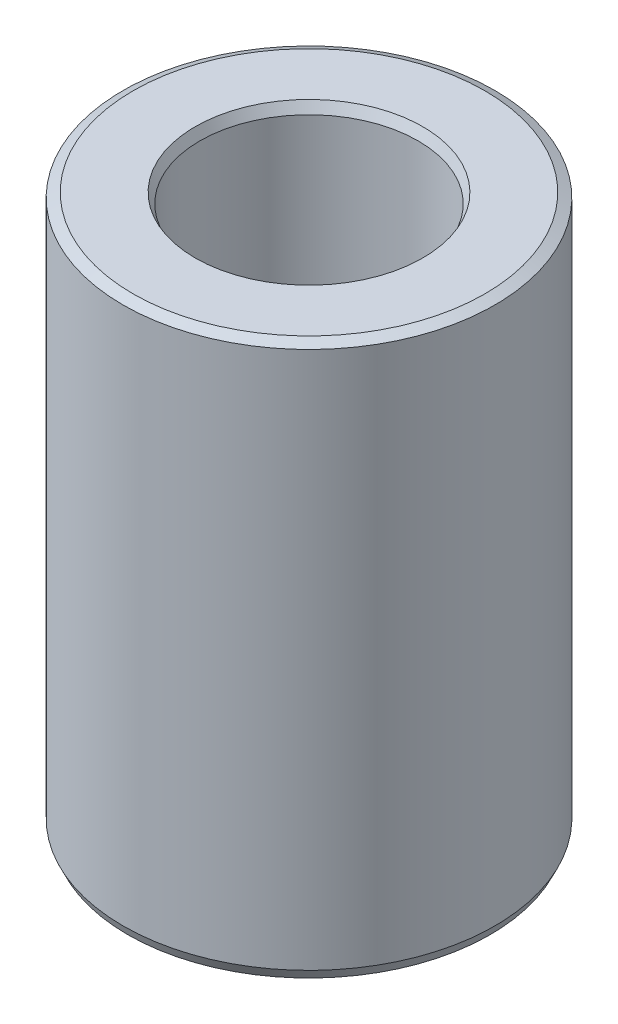
ISO-10303-21;
HEADER;
FILE_DESCRIPTION(('STEP AP214'),'2;1');
FILE_NAME('part.step','',(''),(''),'','','');
FILE_SCHEMA(('AUTOMOTIVE_DESIGN { 1 0 10303 214 1 1 1 1 }'));
ENDSEC;
DATA;
#1=APPLICATION_CONTEXT('core data for automotive mechanical design processes');
#2=APPLICATION_PROTOCOL_DEFINITION('international standard','automotive_design',2000,#1);
#3=PRODUCT_CONTEXT('',#1,'mechanical');
#4=PRODUCT('Part','Part','',(#3));
#5=PRODUCT_RELATED_PRODUCT_CATEGORY('part','',(#4));
#6=PRODUCT_DEFINITION_FORMATION('','',#4);
#7=PRODUCT_DEFINITION_CONTEXT('part definition',#1,'design');
#8=PRODUCT_DEFINITION('design','',#6,#7);
#9=PRODUCT_DEFINITION_SHAPE('','',#8);
#10=(LENGTH_UNIT() NAMED_UNIT(*) SI_UNIT(.MILLI.,.METRE.));
#11=(NAMED_UNIT(*) PLANE_ANGLE_UNIT() SI_UNIT($,.RADIAN.));
#12=(NAMED_UNIT(*) SI_UNIT($,.STERADIAN.) SOLID_ANGLE_UNIT());
#13=UNCERTAINTY_MEASURE_WITH_UNIT(LENGTH_MEASURE(1.E-05),#10,'distance_accuracy_value','');
#14=(GEOMETRIC_REPRESENTATION_CONTEXT(3) GLOBAL_UNCERTAINTY_ASSIGNED_CONTEXT((#13)) GLOBAL_UNIT_ASSIGNED_CONTEXT((#10,
#11,#12)) REPRESENTATION_CONTEXT('',''));
#15=CARTESIAN_POINT('',(0.,0.,0.));
#16=DIRECTION('',(0.,0.,1.));
#17=DIRECTION('',(1.,0.,0.));
#18=AXIS2_PLACEMENT_3D('',#15,#16,#17);
#19=CARTESIAN_POINT('',(0.,141.163090888254,0.));
#20=DIRECTION('',(0.,-1.,0.));
#21=DIRECTION('',(0.,0.,-1.));
#22=AXIS2_PLACEMENT_3D('',#19,#20,#21);
#23=CYLINDRICAL_SURFACE('',#22,47.5);
#24=CARTESIAN_POINT('',(0.,2.54374531594648,0.));
#25=DIRECTION('',(0.,1.,0.));
#26=DIRECTION('',(0.,0.,1.));
#27=AXIS2_PLACEMENT_3D('',#24,#25,#26);
#28=CIRCLE('',#27,47.5);
#29=CARTESIAN_POINT('',(0.,2.54374531594648,47.5));
#30=VERTEX_POINT('',#29);
#31=EDGE_CURVE('E10',#30,#30,#28,.T.);
#32=ORIENTED_EDGE('',*,*,#31,.T.);
#33=EDGE_LOOP('',(#32));
#34=FACE_BOUND('',#33,.T.);
#35=CARTESIAN_POINT('',(0.,139.964572740431,0.));
#36=DIRECTION('',(0.,1.,0.));
#37=DIRECTION('',(0.,0.,1.));
#38=AXIS2_PLACEMENT_3D('',#35,#36,#37);
#39=CIRCLE('',#38,47.5);
#40=CARTESIAN_POINT('',(0.,139.964572740431,47.5));
#41=VERTEX_POINT('',#40);
#42=EDGE_CURVE('E50',#41,#41,#39,.F.);
#43=ORIENTED_EDGE('',*,*,#42,.T.);
#44=EDGE_LOOP('',(#43));
#45=FACE_BOUND('',#44,.T.);
#46=ADVANCED_FACE('F39',(#34,#45),#23,.T.);
#47=CARTESIAN_POINT('',(0.,141.163090888254,0.));
#48=DIRECTION('',(0.,1.,0.));
#49=DIRECTION('',(0.,0.,1.));
#50=AXIS2_PLACEMENT_3D('',#47,#48,#49);
#51=PLANE('',#50);
#52=CARTESIAN_POINT('',(0.,141.163090888254,0.));
#53=DIRECTION('',(0.,1.,0.));
#54=DIRECTION('',(0.,0.,1.));
#55=AXIS2_PLACEMENT_3D('',#52,#53,#54);
#56=CIRCLE('',#55,29.079624289935);
#57=CARTESIAN_POINT('',(0.,141.163090888254,29.079624289935));
#58=VERTEX_POINT('',#57);
#59=EDGE_CURVE('E58',#58,#58,#56,.F.);
#60=ORIENTED_EDGE('',*,*,#59,.T.);
#61=EDGE_LOOP('',(#60));
#62=FACE_BOUND('',#61,.T.);
#63=CARTESIAN_POINT('',(0.,141.163090888254,0.));
#64=DIRECTION('',(0.,1.,0.));
#65=DIRECTION('',(0.,0.,1.));
#66=AXIS2_PLACEMENT_3D('',#63,#64,#65);
#67=CIRCLE('',#66,44.9562546840534);
#68=CARTESIAN_POINT('',(0.,141.163090888254,44.9562546840534));
#69=VERTEX_POINT('',#68);
#70=EDGE_CURVE('E61',#69,#69,#67,.T.);
#71=ORIENTED_EDGE('',*,*,#70,.T.);
#72=EDGE_LOOP('',(#71));
#73=FACE_BOUND('',#72,.T.);
#74=ADVANCED_FACE('F88',(#62,#73),#51,.T.);
#75=CARTESIAN_POINT('',(0.,0.,0.));
#76=DIRECTION('',(0.,1.,0.));
#77=DIRECTION('',(0.,0.,1.));
#78=AXIS2_PLACEMENT_3D('',#75,#76,#77);
#79=PLANE('',#78);
#80=CARTESIAN_POINT('',(0.,0.,0.));
#81=DIRECTION('',(0.,1.,0.));
#82=DIRECTION('',(0.,0.,1.));
#83=AXIS2_PLACEMENT_3D('',#80,#81,#82);
#84=CIRCLE('',#83,30.4248514580588);
#85=CARTESIAN_POINT('',(0.,0.,30.4248514580588));
#86=VERTEX_POINT('',#85);
#87=EDGE_CURVE('E51',#86,#86,#84,.T.);
#88=ORIENTED_EDGE('',*,*,#87,.T.);
#89=EDGE_LOOP('',(#88));
#90=FACE_BOUND('',#89,.T.);
#91=CARTESIAN_POINT('',(0.,0.,0.));
#92=DIRECTION('',(0.,1.,0.));
#93=DIRECTION('',(0.,0.,1.));
#94=AXIS2_PLACEMENT_3D('',#91,#92,#93);
#95=CIRCLE('',#94,46.3014818521773);
#96=CARTESIAN_POINT('',(0.,0.,46.3014818521773));
#97=VERTEX_POINT('',#96);
#98=EDGE_CURVE('E54',#97,#97,#95,.F.);
#99=ORIENTED_EDGE('',*,*,#98,.T.);
#100=EDGE_LOOP('',(#99));
#101=FACE_BOUND('',#100,.T.);
#102=ADVANCED_FACE('F83',(#90,#101),#79,.F.);
#103=CARTESIAN_POINT('',(0.,141.163090888254,0.));
#104=DIRECTION('',(0.,-1.,0.));
#105=DIRECTION('',(0.,0.,-1.));
#106=AXIS2_PLACEMENT_3D('',#103,#104,#105);
#107=CYLINDRICAL_SURFACE('',#106,27.8811061421122);
#108=CARTESIAN_POINT('',(0.,138.619345572307,0.));
#109=DIRECTION('',(0.,1.,0.));
#110=DIRECTION('',(0.,0.,1.));
#111=AXIS2_PLACEMENT_3D('',#108,#109,#110);
#112=CIRCLE('',#111,27.8811061421122);
#113=CARTESIAN_POINT('',(0.,138.619345572307,27.8811061421122));
#114=VERTEX_POINT('',#113);
#115=EDGE_CURVE('E67',#114,#114,#112,.T.);
#116=ORIENTED_EDGE('',*,*,#115,.T.);
#117=EDGE_LOOP('',(#116));
#118=FACE_BOUND('',#117,.T.);
#119=CARTESIAN_POINT('',(0.,1.19851814782274,0.));
#120=DIRECTION('',(0.,1.,0.));
#121=DIRECTION('',(0.,0.,1.));
#122=AXIS2_PLACEMENT_3D('',#119,#120,#121);
#123=CIRCLE('',#122,27.8811061421122);
#124=CARTESIAN_POINT('',(0.,1.19851814782274,27.8811061421122));
#125=VERTEX_POINT('',#124);
#126=EDGE_CURVE('E69',#125,#125,#123,.F.);
#127=ORIENTED_EDGE('',*,*,#126,.T.);
#128=EDGE_LOOP('',(#127));
#129=FACE_BOUND('',#128,.T.);
#130=ADVANCED_FACE('F71',(#118,#129),#107,.F.);
#131=CARTESIAN_POINT('',(0.,138.619345572307,0.));
#132=DIRECTION('',(0.,1.,0.));
#133=DIRECTION('',(0.,0.,1.));
#134=AXIS2_PLACEMENT_3D('',#131,#132,#133);
#135=CONICAL_SURFACE('',#134,27.8811061421122,0.440312867308546);
#136=ORIENTED_EDGE('',*,*,#59,.F.);
#137=EDGE_LOOP('',(#136));
#138=FACE_BOUND('',#137,.T.);
#139=ORIENTED_EDGE('',*,*,#115,.F.);
#140=EDGE_LOOP('',(#139));
#141=FACE_BOUND('',#140,.T.);
#142=ADVANCED_FACE('F77',(#138,#141),#135,.F.);
#143=CARTESIAN_POINT('',(0.,0.,0.));
#144=DIRECTION('',(0.,-1.,0.));
#145=DIRECTION('',(0.,0.,-1.));
#146=AXIS2_PLACEMENT_3D('',#143,#144,#145);
#147=CONICAL_SURFACE('',#146,30.4248514580588,1.13048345948635);
#148=ORIENTED_EDGE('',*,*,#126,.F.);
#149=EDGE_LOOP('',(#148));
#150=FACE_BOUND('',#149,.T.);
#151=ORIENTED_EDGE('',*,*,#87,.F.);
#152=EDGE_LOOP('',(#151));
#153=FACE_BOUND('',#152,.T.);
#154=ADVANCED_FACE('F73',(#150,#153),#147,.F.);
#155=CARTESIAN_POINT('',(0.,2.54374531594648,0.));
#156=DIRECTION('',(0.,1.,0.));
#157=DIRECTION('',(0.,0.,1.));
#158=AXIS2_PLACEMENT_3D('',#155,#156,#157);
#159=CONICAL_SURFACE('',#158,47.5,0.440312867308553);
#160=ORIENTED_EDGE('',*,*,#98,.F.);
#161=EDGE_LOOP('',(#160));
#162=FACE_BOUND('',#161,.T.);
#163=ORIENTED_EDGE('',*,*,#31,.F.);
#164=EDGE_LOOP('',(#163));
#165=FACE_BOUND('',#164,.T.);
#166=ADVANCED_FACE('F76',(#162,#165),#159,.T.);
#167=CARTESIAN_POINT('',(0.,141.163090888254,0.));
#168=DIRECTION('',(0.,-1.,0.));
#169=DIRECTION('',(0.,0.,-1.));
#170=AXIS2_PLACEMENT_3D('',#167,#168,#169);
#171=CONICAL_SURFACE('',#170,44.9562546840534,1.13048345948635);
#172=ORIENTED_EDGE('',*,*,#42,.F.);
#173=EDGE_LOOP('',(#172));
#174=FACE_BOUND('',#173,.T.);
#175=ORIENTED_EDGE('',*,*,#70,.F.);
#176=EDGE_LOOP('',(#175));
#177=FACE_BOUND('',#176,.T.);
#178=ADVANCED_FACE('F45',(#174,#177),#171,.T.);
#179=CLOSED_SHELL('',(#46,#74,#102,#130,#142,#154,#166,#178));
#180=MANIFOLD_SOLID_BREP('B2',#179);
#181=ADVANCED_BREP_SHAPE_REPRESENTATION('',(#18,#180),#14);
#182=SHAPE_DEFINITION_REPRESENTATION(#9,#181);
ENDSEC;
END-ISO-10303-21;
